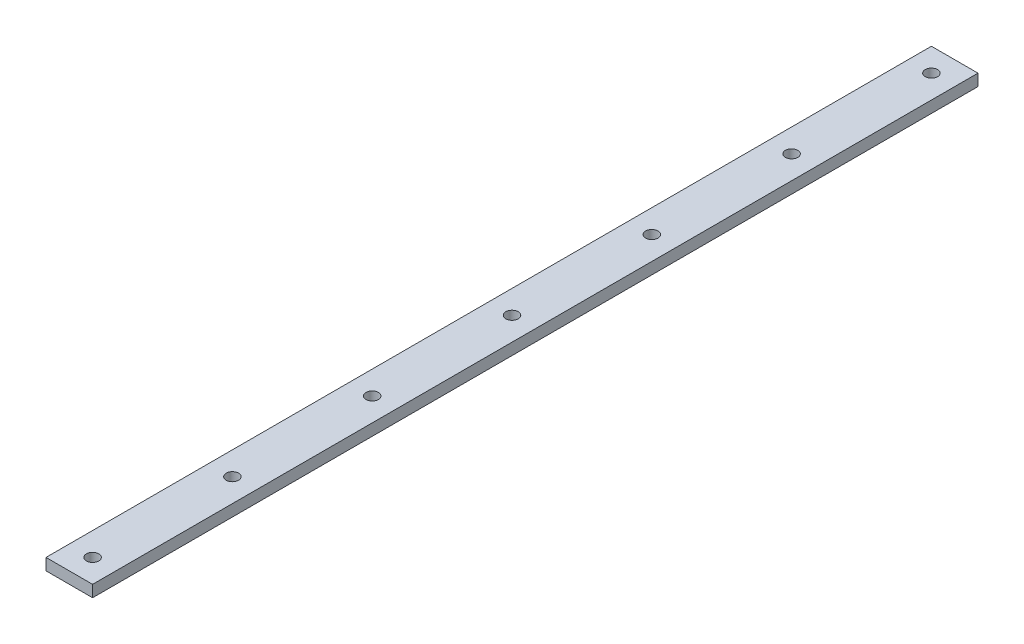
ISO-10303-21;
HEADER;
FILE_DESCRIPTION(('STEP AP214'),'2;1');
FILE_NAME('part.step','',(''),(''),'','','');
FILE_SCHEMA(('AUTOMOTIVE_DESIGN { 1 0 10303 214 1 1 1 1 }'));
ENDSEC;
DATA;
#1=APPLICATION_CONTEXT('core data for automotive mechanical design processes');
#2=APPLICATION_PROTOCOL_DEFINITION('international standard','automotive_design',2000,#1);
#3=PRODUCT_CONTEXT('',#1,'mechanical');
#4=PRODUCT('Part','Part','',(#3));
#5=PRODUCT_RELATED_PRODUCT_CATEGORY('part','',(#4));
#6=PRODUCT_DEFINITION_FORMATION('','',#4);
#7=PRODUCT_DEFINITION_CONTEXT('part definition',#1,'design');
#8=PRODUCT_DEFINITION('design','',#6,#7);
#9=PRODUCT_DEFINITION_SHAPE('','',#8);
#10=(LENGTH_UNIT() NAMED_UNIT(*) SI_UNIT(.MILLI.,.METRE.));
#11=(NAMED_UNIT(*) PLANE_ANGLE_UNIT() SI_UNIT($,.RADIAN.));
#12=(NAMED_UNIT(*) SI_UNIT($,.STERADIAN.) SOLID_ANGLE_UNIT());
#13=UNCERTAINTY_MEASURE_WITH_UNIT(LENGTH_MEASURE(1.E-05),#10,'distance_accuracy_value','');
#14=(GEOMETRIC_REPRESENTATION_CONTEXT(3) GLOBAL_UNCERTAINTY_ASSIGNED_CONTEXT((#13)) GLOBAL_UNIT_ASSIGNED_CONTEXT((#10,
#11,#12)) REPRESENTATION_CONTEXT('',''));
#15=CARTESIAN_POINT('',(0.,0.,0.));
#16=DIRECTION('',(0.,0.,1.));
#17=DIRECTION('',(1.,0.,0.));
#18=AXIS2_PLACEMENT_3D('',#15,#16,#17);
#19=CARTESIAN_POINT('',(0.,6.35,0.));
#20=DIRECTION('',(-1.,0.,0.));
#21=DIRECTION('',(0.,0.,1.));
#22=AXIS2_PLACEMENT_3D('',#19,#20,#21);
#23=PLANE('',#22);
#24=DIRECTION('',(0.,0.,-1.));
#25=VECTOR('',#24,1.);
#26=CARTESIAN_POINT('',(0.,0.,0.));
#27=LINE('',#26,#25);
#28=CARTESIAN_POINT('',(0.,0.,0.));
#29=VERTEX_POINT('',#28);
#30=CARTESIAN_POINT('',(0.,0.,-482.6));
#31=VERTEX_POINT('',#30);
#32=EDGE_CURVE('E102',#29,#31,#27,.T.);
#33=ORIENTED_EDGE('',*,*,#32,.T.);
#34=DIRECTION('',(0.,-1.,0.));
#35=VECTOR('',#34,1.);
#36=CARTESIAN_POINT('',(0.,6.35,-482.6));
#37=LINE('',#36,#35);
#38=CARTESIAN_POINT('',(0.,6.35,-482.6));
#39=VERTEX_POINT('',#38);
#40=EDGE_CURVE('E11',#39,#31,#37,.T.);
#41=ORIENTED_EDGE('',*,*,#40,.F.);
#42=DIRECTION('',(0.,0.,-1.));
#43=VECTOR('',#42,1.);
#44=CARTESIAN_POINT('',(0.,6.35,0.));
#45=LINE('',#44,#43);
#46=CARTESIAN_POINT('',(0.,6.35,0.));
#47=VERTEX_POINT('',#46);
#48=EDGE_CURVE('E88',#47,#39,#45,.T.);
#49=ORIENTED_EDGE('',*,*,#48,.F.);
#50=DIRECTION('',(0.,-1.,0.));
#51=VECTOR('',#50,1.);
#52=CARTESIAN_POINT('',(0.,6.35,0.));
#53=LINE('',#52,#51);
#54=EDGE_CURVE('E98',#47,#29,#53,.T.);
#55=ORIENTED_EDGE('',*,*,#54,.T.);
#56=EDGE_LOOP('',(#33,#41,#49,#55));
#57=FACE_BOUND('',#56,.T.);
#58=ADVANCED_FACE('F37',(#57),#23,.F.);
#59=CARTESIAN_POINT('',(0.,6.35,-482.6));
#60=DIRECTION('',(0.,0.,1.));
#61=DIRECTION('',(1.,0.,0.));
#62=AXIS2_PLACEMENT_3D('',#59,#60,#61);
#63=PLANE('',#62);
#64=DIRECTION('',(-1.,0.,0.));
#65=VECTOR('',#64,1.);
#66=CARTESIAN_POINT('',(0.,0.,-482.6));
#67=LINE('',#66,#65);
#68=CARTESIAN_POINT('',(-25.4,0.,-482.6));
#69=VERTEX_POINT('',#68);
#70=EDGE_CURVE('E92',#31,#69,#67,.T.);
#71=ORIENTED_EDGE('',*,*,#70,.T.);
#72=DIRECTION('',(0.,-1.,0.));
#73=VECTOR('',#72,1.);
#74=CARTESIAN_POINT('',(-25.4,6.35,-482.6));
#75=LINE('',#74,#73);
#76=CARTESIAN_POINT('',(-25.4,6.35,-482.6));
#77=VERTEX_POINT('',#76);
#78=EDGE_CURVE('E45',#77,#69,#75,.T.);
#79=ORIENTED_EDGE('',*,*,#78,.F.);
#80=DIRECTION('',(-1.,0.,0.));
#81=VECTOR('',#80,1.);
#82=CARTESIAN_POINT('',(0.,6.35,-482.6));
#83=LINE('',#82,#81);
#84=EDGE_CURVE('E83',#39,#77,#83,.T.);
#85=ORIENTED_EDGE('',*,*,#84,.F.);
#86=ORIENTED_EDGE('',*,*,#40,.T.);
#87=EDGE_LOOP('',(#71,#79,#85,#86));
#88=FACE_BOUND('',#87,.T.);
#89=ADVANCED_FACE('F91',(#88),#63,.F.);
#90=CARTESIAN_POINT('',(-25.4,6.35,0.));
#91=DIRECTION('',(1.,0.,0.));
#92=DIRECTION('',(0.,0.,-1.));
#93=AXIS2_PLACEMENT_3D('',#90,#91,#92);
#94=PLANE('',#93);
#95=DIRECTION('',(0.,0.,1.));
#96=VECTOR('',#95,1.);
#97=CARTESIAN_POINT('',(-25.4,0.,0.));
#98=LINE('',#97,#96);
#99=CARTESIAN_POINT('',(-25.4,0.,0.));
#100=VERTEX_POINT('',#99);
#101=EDGE_CURVE('E70',#69,#100,#98,.T.);
#102=ORIENTED_EDGE('',*,*,#101,.T.);
#103=DIRECTION('',(0.,-1.,0.));
#104=VECTOR('',#103,1.);
#105=CARTESIAN_POINT('',(-25.4,6.35,0.));
#106=LINE('',#105,#104);
#107=CARTESIAN_POINT('',(-25.4,6.35,0.));
#108=VERTEX_POINT('',#107);
#109=EDGE_CURVE('E93',#108,#100,#106,.T.);
#110=ORIENTED_EDGE('',*,*,#109,.F.);
#111=DIRECTION('',(0.,0.,1.));
#112=VECTOR('',#111,1.);
#113=CARTESIAN_POINT('',(-25.4,6.35,0.));
#114=LINE('',#113,#112);
#115=EDGE_CURVE('E86',#77,#108,#114,.T.);
#116=ORIENTED_EDGE('',*,*,#115,.F.);
#117=ORIENTED_EDGE('',*,*,#78,.T.);
#118=EDGE_LOOP('',(#102,#110,#116,#117));
#119=FACE_BOUND('',#118,.T.);
#120=ADVANCED_FACE('F94',(#119),#94,.F.);
#121=CARTESIAN_POINT('',(0.,6.35,0.));
#122=DIRECTION('',(0.,0.,-1.));
#123=DIRECTION('',(-1.,0.,0.));
#124=AXIS2_PLACEMENT_3D('',#121,#122,#123);
#125=PLANE('',#124);
#126=DIRECTION('',(1.,0.,0.));
#127=VECTOR('',#126,1.);
#128=CARTESIAN_POINT('',(0.,0.,0.));
#129=LINE('',#128,#127);
#130=EDGE_CURVE('E76',#100,#29,#129,.T.);
#131=ORIENTED_EDGE('',*,*,#130,.T.);
#132=ORIENTED_EDGE('',*,*,#54,.F.);
#133=DIRECTION('',(1.,0.,0.));
#134=VECTOR('',#133,1.);
#135=CARTESIAN_POINT('',(0.,6.35,0.));
#136=LINE('',#135,#134);
#137=EDGE_CURVE('E53',#108,#47,#136,.T.);
#138=ORIENTED_EDGE('',*,*,#137,.F.);
#139=ORIENTED_EDGE('',*,*,#109,.T.);
#140=EDGE_LOOP('',(#131,#132,#138,#139));
#141=FACE_BOUND('',#140,.T.);
#142=ADVANCED_FACE('F111',(#141),#125,.F.);
#143=CARTESIAN_POINT('',(0.,6.35,0.));
#144=DIRECTION('',(0.,1.,0.));
#145=DIRECTION('',(0.,0.,1.));
#146=AXIS2_PLACEMENT_3D('',#143,#144,#145);
#147=PLANE('',#146);
#148=CARTESIAN_POINT('',(-12.7,6.35,-12.7));
#149=DIRECTION('',(0.,1.,0.));
#150=DIRECTION('',(0.,0.,1.));
#151=AXIS2_PLACEMENT_3D('',#148,#149,#150);
#152=CIRCLE('',#151,3.3782);
#153=CARTESIAN_POINT('',(-12.7,6.35,-9.3218));
#154=VERTEX_POINT('',#153);
#155=EDGE_CURVE('E158',#154,#154,#152,.T.);
#156=ORIENTED_EDGE('',*,*,#155,.F.);
#157=EDGE_LOOP('',(#156));
#158=FACE_BOUND('',#157,.T.);
#159=CARTESIAN_POINT('',(-12.7000000000003,6.35,-88.9));
#160=DIRECTION('',(0.,1.,0.));
#161=DIRECTION('',(0.,0.,1.));
#162=AXIS2_PLACEMENT_3D('',#159,#160,#161);
#163=CIRCLE('',#162,3.3782);
#164=CARTESIAN_POINT('',(-12.7000000000003,6.35,-85.5218));
#165=VERTEX_POINT('',#164);
#166=EDGE_CURVE('E152',#165,#165,#163,.T.);
#167=ORIENTED_EDGE('',*,*,#166,.F.);
#168=EDGE_LOOP('',(#167));
#169=FACE_BOUND('',#168,.T.);
#170=CARTESIAN_POINT('',(-12.7000000000005,6.35,-165.1));
#171=DIRECTION('',(0.,1.,0.));
#172=DIRECTION('',(0.,0.,1.));
#173=AXIS2_PLACEMENT_3D('',#170,#171,#172);
#174=CIRCLE('',#173,3.3782);
#175=CARTESIAN_POINT('',(-12.7000000000005,6.35,-161.7218));
#176=VERTEX_POINT('',#175);
#177=EDGE_CURVE('E146',#176,#176,#174,.T.);
#178=ORIENTED_EDGE('',*,*,#177,.F.);
#179=EDGE_LOOP('',(#178));
#180=FACE_BOUND('',#179,.T.);
#181=CARTESIAN_POINT('',(-12.7000000000008,6.35,-241.3));
#182=DIRECTION('',(0.,1.,0.));
#183=DIRECTION('',(0.,0.,1.));
#184=AXIS2_PLACEMENT_3D('',#181,#182,#183);
#185=CIRCLE('',#184,3.3782);
#186=CARTESIAN_POINT('',(-12.7000000000008,6.35,-237.9218));
#187=VERTEX_POINT('',#186);
#188=EDGE_CURVE('E140',#187,#187,#185,.T.);
#189=ORIENTED_EDGE('',*,*,#188,.F.);
#190=EDGE_LOOP('',(#189));
#191=FACE_BOUND('',#190,.T.);
#192=CARTESIAN_POINT('',(-12.700000000001,6.35,-317.5));
#193=DIRECTION('',(0.,1.,0.));
#194=DIRECTION('',(0.,0.,1.));
#195=AXIS2_PLACEMENT_3D('',#192,#193,#194);
#196=CIRCLE('',#195,3.3782);
#197=CARTESIAN_POINT('',(-12.700000000001,6.35,-314.1218));
#198=VERTEX_POINT('',#197);
#199=EDGE_CURVE('E133',#198,#198,#196,.T.);
#200=ORIENTED_EDGE('',*,*,#199,.F.);
#201=EDGE_LOOP('',(#200));
#202=FACE_BOUND('',#201,.T.);
#203=CARTESIAN_POINT('',(-12.7000000000013,6.35,-393.7));
#204=DIRECTION('',(0.,1.,0.));
#205=DIRECTION('',(0.,0.,1.));
#206=AXIS2_PLACEMENT_3D('',#203,#204,#205);
#207=CIRCLE('',#206,3.3782);
#208=CARTESIAN_POINT('',(-12.7000000000013,6.35,-390.3218));
#209=VERTEX_POINT('',#208);
#210=EDGE_CURVE('E126',#209,#209,#207,.T.);
#211=ORIENTED_EDGE('',*,*,#210,.F.);
#212=EDGE_LOOP('',(#211));
#213=FACE_BOUND('',#212,.T.);
#214=CARTESIAN_POINT('',(-12.7000000000017,6.35,-469.9));
#215=DIRECTION('',(0.,1.,0.));
#216=DIRECTION('',(0.,0.,1.));
#217=AXIS2_PLACEMENT_3D('',#214,#215,#216);
#218=CIRCLE('',#217,3.3782);
#219=CARTESIAN_POINT('',(-12.7000000000017,6.35,-466.5218));
#220=VERTEX_POINT('',#219);
#221=EDGE_CURVE('E120',#220,#220,#218,.T.);
#222=ORIENTED_EDGE('',*,*,#221,.F.);
#223=EDGE_LOOP('',(#222));
#224=FACE_BOUND('',#223,.T.);
#225=ORIENTED_EDGE('',*,*,#48,.T.);
#226=ORIENTED_EDGE('',*,*,#84,.T.);
#227=ORIENTED_EDGE('',*,*,#115,.T.);
#228=ORIENTED_EDGE('',*,*,#137,.T.);
#229=EDGE_LOOP('',(#225,#226,#227,#228));
#230=FACE_BOUND('',#229,.T.);
#231=ADVANCED_FACE('F84',(#158,#169,#180,#191,#202,#213,#224,#230),#147,.T.);
#232=CARTESIAN_POINT('',(0.,0.,0.));
#233=DIRECTION('',(0.,1.,0.));
#234=DIRECTION('',(0.,0.,1.));
#235=AXIS2_PLACEMENT_3D('',#232,#233,#234);
#236=PLANE('',#235);
#237=CARTESIAN_POINT('',(-12.7,0.,-12.7));
#238=DIRECTION('',(0.,1.,0.));
#239=DIRECTION('',(0.,0.,1.));
#240=AXIS2_PLACEMENT_3D('',#237,#238,#239);
#241=CIRCLE('',#240,3.3782);
#242=CARTESIAN_POINT('',(-12.7,0.,-9.3218));
#243=VERTEX_POINT('',#242);
#244=EDGE_CURVE('E155',#243,#243,#241,.T.);
#245=ORIENTED_EDGE('',*,*,#244,.T.);
#246=EDGE_LOOP('',(#245));
#247=FACE_BOUND('',#246,.T.);
#248=CARTESIAN_POINT('',(-12.7000000000003,0.,-88.9));
#249=DIRECTION('',(0.,1.,0.));
#250=DIRECTION('',(0.,0.,1.));
#251=AXIS2_PLACEMENT_3D('',#248,#249,#250);
#252=CIRCLE('',#251,3.3782);
#253=CARTESIAN_POINT('',(-12.7000000000003,0.,-85.5218));
#254=VERTEX_POINT('',#253);
#255=EDGE_CURVE('E149',#254,#254,#252,.T.);
#256=ORIENTED_EDGE('',*,*,#255,.T.);
#257=EDGE_LOOP('',(#256));
#258=FACE_BOUND('',#257,.T.);
#259=CARTESIAN_POINT('',(-12.7000000000005,0.,-165.1));
#260=DIRECTION('',(0.,1.,0.));
#261=DIRECTION('',(0.,0.,1.));
#262=AXIS2_PLACEMENT_3D('',#259,#260,#261);
#263=CIRCLE('',#262,3.3782);
#264=CARTESIAN_POINT('',(-12.7000000000005,0.,-161.7218));
#265=VERTEX_POINT('',#264);
#266=EDGE_CURVE('E143',#265,#265,#263,.T.);
#267=ORIENTED_EDGE('',*,*,#266,.T.);
#268=EDGE_LOOP('',(#267));
#269=FACE_BOUND('',#268,.T.);
#270=CARTESIAN_POINT('',(-12.7000000000008,0.,-241.3));
#271=DIRECTION('',(0.,1.,0.));
#272=DIRECTION('',(0.,0.,1.));
#273=AXIS2_PLACEMENT_3D('',#270,#271,#272);
#274=CIRCLE('',#273,3.3782);
#275=CARTESIAN_POINT('',(-12.7000000000008,0.,-237.9218));
#276=VERTEX_POINT('',#275);
#277=EDGE_CURVE('E137',#276,#276,#274,.T.);
#278=ORIENTED_EDGE('',*,*,#277,.T.);
#279=EDGE_LOOP('',(#278));
#280=FACE_BOUND('',#279,.T.);
#281=CARTESIAN_POINT('',(-12.700000000001,0.,-317.5));
#282=DIRECTION('',(0.,1.,0.));
#283=DIRECTION('',(0.,0.,1.));
#284=AXIS2_PLACEMENT_3D('',#281,#282,#283);
#285=CIRCLE('',#284,3.3782);
#286=CARTESIAN_POINT('',(-12.700000000001,0.,-314.1218));
#287=VERTEX_POINT('',#286);
#288=EDGE_CURVE('E129',#287,#287,#285,.T.);
#289=ORIENTED_EDGE('',*,*,#288,.T.);
#290=EDGE_LOOP('',(#289));
#291=FACE_BOUND('',#290,.T.);
#292=CARTESIAN_POINT('',(-12.7000000000013,0.,-393.7));
#293=DIRECTION('',(0.,1.,0.));
#294=DIRECTION('',(0.,0.,1.));
#295=AXIS2_PLACEMENT_3D('',#292,#293,#294);
#296=CIRCLE('',#295,3.3782);
#297=CARTESIAN_POINT('',(-12.7000000000013,0.,-390.3218));
#298=VERTEX_POINT('',#297);
#299=EDGE_CURVE('E123',#298,#298,#296,.T.);
#300=ORIENTED_EDGE('',*,*,#299,.T.);
#301=EDGE_LOOP('',(#300));
#302=FACE_BOUND('',#301,.T.);
#303=CARTESIAN_POINT('',(-12.7000000000017,0.,-469.9));
#304=DIRECTION('',(0.,1.,0.));
#305=DIRECTION('',(0.,0.,1.));
#306=AXIS2_PLACEMENT_3D('',#303,#304,#305);
#307=CIRCLE('',#306,3.3782);
#308=CARTESIAN_POINT('',(-12.7000000000017,0.,-466.5218));
#309=VERTEX_POINT('',#308);
#310=EDGE_CURVE('E106',#309,#309,#307,.T.);
#311=ORIENTED_EDGE('',*,*,#310,.T.);
#312=EDGE_LOOP('',(#311));
#313=FACE_BOUND('',#312,.T.);
#314=ORIENTED_EDGE('',*,*,#32,.F.);
#315=ORIENTED_EDGE('',*,*,#130,.F.);
#316=ORIENTED_EDGE('',*,*,#101,.F.);
#317=ORIENTED_EDGE('',*,*,#70,.F.);
#318=EDGE_LOOP('',(#314,#315,#316,#317));
#319=FACE_BOUND('',#318,.T.);
#320=ADVANCED_FACE('F114',(#247,#258,#269,#280,#291,#302,#313,#319),#236,.F.);
#321=CARTESIAN_POINT('',(-12.7000000000017,6.35,-469.9));
#322=DIRECTION('',(0.,1.,0.));
#323=DIRECTION('',(0.,0.,1.));
#324=AXIS2_PLACEMENT_3D('',#321,#322,#323);
#325=CYLINDRICAL_SURFACE('',#324,3.3782);
#326=ORIENTED_EDGE('',*,*,#310,.F.);
#327=EDGE_LOOP('',(#326));
#328=FACE_BOUND('',#327,.T.);
#329=ORIENTED_EDGE('',*,*,#221,.T.);
#330=EDGE_LOOP('',(#329));
#331=FACE_BOUND('',#330,.T.);
#332=ADVANCED_FACE('F179',(#328,#331),#325,.F.);
#333=CARTESIAN_POINT('',(-12.7000000000013,6.35,-393.7));
#334=DIRECTION('',(0.,1.,0.));
#335=DIRECTION('',(0.,0.,1.));
#336=AXIS2_PLACEMENT_3D('',#333,#334,#335);
#337=CYLINDRICAL_SURFACE('',#336,3.3782);
#338=ORIENTED_EDGE('',*,*,#299,.F.);
#339=EDGE_LOOP('',(#338));
#340=FACE_BOUND('',#339,.T.);
#341=ORIENTED_EDGE('',*,*,#210,.T.);
#342=EDGE_LOOP('',(#341));
#343=FACE_BOUND('',#342,.T.);
#344=ADVANCED_FACE('F181',(#340,#343),#337,.F.);
#345=CARTESIAN_POINT('',(-12.700000000001,6.35,-317.5));
#346=DIRECTION('',(0.,1.,0.));
#347=DIRECTION('',(0.,0.,1.));
#348=AXIS2_PLACEMENT_3D('',#345,#346,#347);
#349=CYLINDRICAL_SURFACE('',#348,3.3782);
#350=ORIENTED_EDGE('',*,*,#288,.F.);
#351=EDGE_LOOP('',(#350));
#352=FACE_BOUND('',#351,.T.);
#353=ORIENTED_EDGE('',*,*,#199,.T.);
#354=EDGE_LOOP('',(#353));
#355=FACE_BOUND('',#354,.T.);
#356=ADVANCED_FACE('F188',(#352,#355),#349,.F.);
#357=CARTESIAN_POINT('',(-12.7000000000008,6.35,-241.3));
#358=DIRECTION('',(0.,1.,0.));
#359=DIRECTION('',(0.,0.,1.));
#360=AXIS2_PLACEMENT_3D('',#357,#358,#359);
#361=CYLINDRICAL_SURFACE('',#360,3.3782);
#362=ORIENTED_EDGE('',*,*,#277,.F.);
#363=EDGE_LOOP('',(#362));
#364=FACE_BOUND('',#363,.T.);
#365=ORIENTED_EDGE('',*,*,#188,.T.);
#366=EDGE_LOOP('',(#365));
#367=FACE_BOUND('',#366,.T.);
#368=ADVANCED_FACE('F237',(#364,#367),#361,.F.);
#369=CARTESIAN_POINT('',(-12.7000000000005,6.35,-165.1));
#370=DIRECTION('',(0.,1.,0.));
#371=DIRECTION('',(0.,0.,1.));
#372=AXIS2_PLACEMENT_3D('',#369,#370,#371);
#373=CYLINDRICAL_SURFACE('',#372,3.3782);
#374=ORIENTED_EDGE('',*,*,#266,.F.);
#375=EDGE_LOOP('',(#374));
#376=FACE_BOUND('',#375,.T.);
#377=ORIENTED_EDGE('',*,*,#177,.T.);
#378=EDGE_LOOP('',(#377));
#379=FACE_BOUND('',#378,.T.);
#380=ADVANCED_FACE('F247',(#376,#379),#373,.F.);
#381=CARTESIAN_POINT('',(-12.7000000000003,6.35,-88.9));
#382=DIRECTION('',(0.,1.,0.));
#383=DIRECTION('',(0.,0.,1.));
#384=AXIS2_PLACEMENT_3D('',#381,#382,#383);
#385=CYLINDRICAL_SURFACE('',#384,3.3782);
#386=ORIENTED_EDGE('',*,*,#255,.F.);
#387=EDGE_LOOP('',(#386));
#388=FACE_BOUND('',#387,.T.);
#389=ORIENTED_EDGE('',*,*,#166,.T.);
#390=EDGE_LOOP('',(#389));
#391=FACE_BOUND('',#390,.T.);
#392=ADVANCED_FACE('F257',(#388,#391),#385,.F.);
#393=CARTESIAN_POINT('',(-12.7,6.35,-12.7));
#394=DIRECTION('',(0.,1.,0.));
#395=DIRECTION('',(0.,0.,1.));
#396=AXIS2_PLACEMENT_3D('',#393,#394,#395);
#397=CYLINDRICAL_SURFACE('',#396,3.3782);
#398=ORIENTED_EDGE('',*,*,#244,.F.);
#399=EDGE_LOOP('',(#398));
#400=FACE_BOUND('',#399,.T.);
#401=ORIENTED_EDGE('',*,*,#155,.T.);
#402=EDGE_LOOP('',(#401));
#403=FACE_BOUND('',#402,.T.);
#404=ADVANCED_FACE('F162',(#400,#403),#397,.F.);
#405=CLOSED_SHELL('',(#58,#89,#120,#142,#231,#320,#332,#344,#356,#368,#380,#392,#404));
#406=MANIFOLD_SOLID_BREP('B2',#405);
#407=ADVANCED_BREP_SHAPE_REPRESENTATION('',(#18,#406),#14);
#408=SHAPE_DEFINITION_REPRESENTATION(#9,#407);
ENDSEC;
END-ISO-10303-21;
